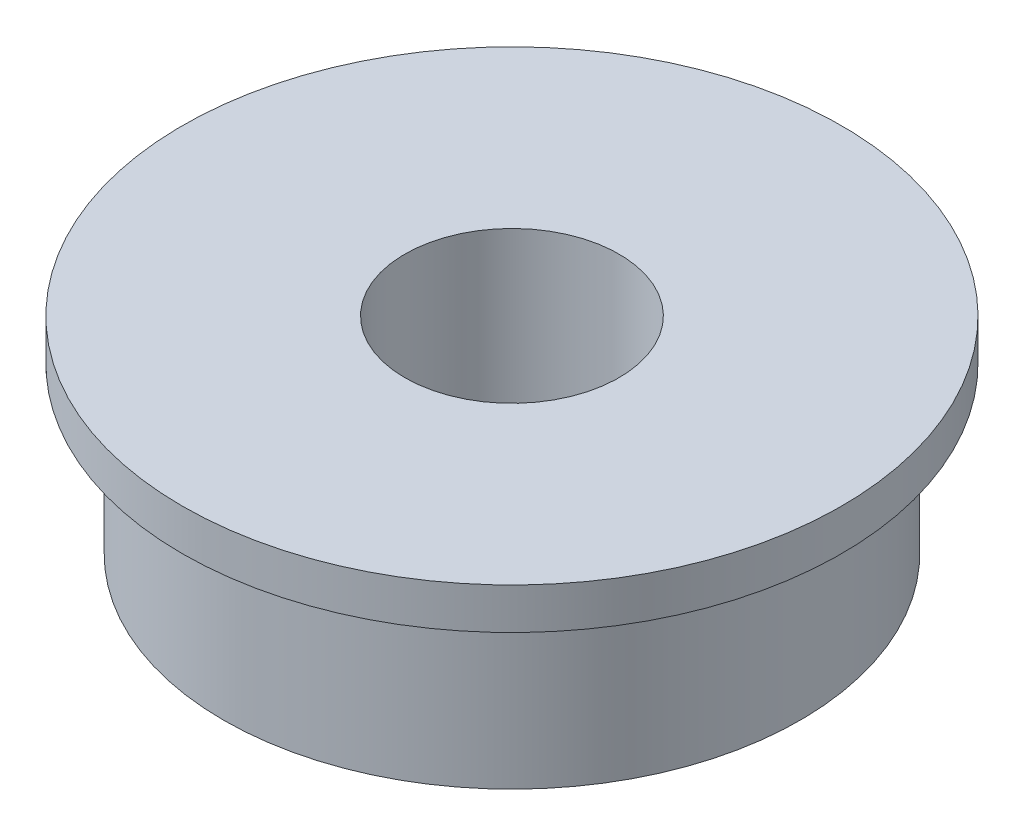
ISO-10303-21;
HEADER;
FILE_DESCRIPTION(('STEP AP214'),'2;1');
FILE_NAME('part.step','',(''),(''),'','','');
FILE_SCHEMA(('AUTOMOTIVE_DESIGN { 1 0 10303 214 1 1 1 1 }'));
ENDSEC;
DATA;
#1=APPLICATION_CONTEXT('core data for automotive mechanical design processes');
#2=APPLICATION_PROTOCOL_DEFINITION('international standard','automotive_design',2000,#1);
#3=PRODUCT_CONTEXT('',#1,'mechanical');
#4=PRODUCT('Part','Part','',(#3));
#5=PRODUCT_RELATED_PRODUCT_CATEGORY('part','',(#4));
#6=PRODUCT_DEFINITION_FORMATION('','',#4);
#7=PRODUCT_DEFINITION_CONTEXT('part definition',#1,'design');
#8=PRODUCT_DEFINITION('design','',#6,#7);
#9=PRODUCT_DEFINITION_SHAPE('','',#8);
#10=(LENGTH_UNIT() NAMED_UNIT(*) SI_UNIT(.MILLI.,.METRE.));
#11=(NAMED_UNIT(*) PLANE_ANGLE_UNIT() SI_UNIT($,.RADIAN.));
#12=(NAMED_UNIT(*) SI_UNIT($,.STERADIAN.) SOLID_ANGLE_UNIT());
#13=UNCERTAINTY_MEASURE_WITH_UNIT(LENGTH_MEASURE(1.E-05),#10,'distance_accuracy_value','');
#14=(GEOMETRIC_REPRESENTATION_CONTEXT(3) GLOBAL_UNCERTAINTY_ASSIGNED_CONTEXT((#13)) GLOBAL_UNIT_ASSIGNED_CONTEXT((#10,
#11,#12)) REPRESENTATION_CONTEXT('',''));
#15=CARTESIAN_POINT('',(0.,0.,0.));
#16=DIRECTION('',(0.,0.,1.));
#17=DIRECTION('',(1.,0.,0.));
#18=AXIS2_PLACEMENT_3D('',#15,#16,#17);
#19=CARTESIAN_POINT('',(0.,5.,0.));
#20=DIRECTION('',(0.,-1.,0.));
#21=DIRECTION('',(0.,0.,-1.));
#22=AXIS2_PLACEMENT_3D('',#19,#20,#21);
#23=CYLINDRICAL_SURFACE('',#22,7.);
#24=CARTESIAN_POINT('',(0.,0.,0.));
#25=DIRECTION('',(0.,1.,0.));
#26=DIRECTION('',(0.,0.,1.));
#27=AXIS2_PLACEMENT_3D('',#24,#25,#26);
#28=CIRCLE('',#27,7.);
#29=CARTESIAN_POINT('',(0.,0.,7.));
#30=VERTEX_POINT('',#29);
#31=EDGE_CURVE('E37',#30,#30,#28,.T.);
#32=ORIENTED_EDGE('',*,*,#31,.T.);
#33=EDGE_LOOP('',(#32));
#34=FACE_BOUND('',#33,.T.);
#35=CARTESIAN_POINT('',(0.,4.,0.));
#36=DIRECTION('',(0.,1.,0.));
#37=DIRECTION('',(0.,0.,1.));
#38=AXIS2_PLACEMENT_3D('',#35,#36,#37);
#39=CIRCLE('',#38,7.);
#40=CARTESIAN_POINT('',(0.,4.,7.));
#41=VERTEX_POINT('',#40);
#42=EDGE_CURVE('E10',#41,#41,#39,.T.);
#43=ORIENTED_EDGE('',*,*,#42,.F.);
#44=EDGE_LOOP('',(#43));
#45=FACE_BOUND('',#44,.T.);
#46=ADVANCED_FACE('F34',(#34,#45),#23,.T.);
#47=CARTESIAN_POINT('',(0.,5.,0.));
#48=DIRECTION('',(0.,1.,0.));
#49=DIRECTION('',(0.,0.,1.));
#50=AXIS2_PLACEMENT_3D('',#47,#48,#49);
#51=PLANE('',#50);
#52=CARTESIAN_POINT('',(0.,5.,0.));
#53=DIRECTION('',(0.,1.,0.));
#54=DIRECTION('',(0.,0.,1.));
#55=AXIS2_PLACEMENT_3D('',#52,#53,#54);
#56=CIRCLE('',#55,2.6);
#57=CARTESIAN_POINT('',(0.,5.,2.6));
#58=VERTEX_POINT('',#57);
#59=EDGE_CURVE('E45',#58,#58,#56,.T.);
#60=ORIENTED_EDGE('',*,*,#59,.F.);
#61=EDGE_LOOP('',(#60));
#62=FACE_BOUND('',#61,.T.);
#63=CARTESIAN_POINT('',(0.,5.,0.));
#64=DIRECTION('',(0.,1.,0.));
#65=DIRECTION('',(0.,0.,1.));
#66=AXIS2_PLACEMENT_3D('',#63,#64,#65);
#67=CIRCLE('',#66,8.);
#68=CARTESIAN_POINT('',(0.,5.,8.));
#69=VERTEX_POINT('',#68);
#70=EDGE_CURVE('E48',#69,#69,#67,.T.);
#71=ORIENTED_EDGE('',*,*,#70,.T.);
#72=EDGE_LOOP('',(#71));
#73=FACE_BOUND('',#72,.T.);
#74=ADVANCED_FACE('F62',(#62,#73),#51,.T.);
#75=CARTESIAN_POINT('',(0.,0.,0.));
#76=DIRECTION('',(0.,1.,0.));
#77=DIRECTION('',(0.,0.,1.));
#78=AXIS2_PLACEMENT_3D('',#75,#76,#77);
#79=PLANE('',#78);
#80=ORIENTED_EDGE('',*,*,#31,.F.);
#81=EDGE_LOOP('',(#80));
#82=FACE_BOUND('',#81,.T.);
#83=CARTESIAN_POINT('',(0.,0.,0.));
#84=DIRECTION('',(0.,1.,0.));
#85=DIRECTION('',(0.,0.,1.));
#86=AXIS2_PLACEMENT_3D('',#83,#84,#85);
#87=CIRCLE('',#86,2.6);
#88=CARTESIAN_POINT('',(0.,0.,2.6));
#89=VERTEX_POINT('',#88);
#90=EDGE_CURVE('E51',#89,#89,#87,.T.);
#91=ORIENTED_EDGE('',*,*,#90,.T.);
#92=EDGE_LOOP('',(#91));
#93=FACE_BOUND('',#92,.T.);
#94=ADVANCED_FACE('F80',(#82,#93),#79,.F.);
#95=CARTESIAN_POINT('',(0.,5.,0.));
#96=DIRECTION('',(0.,-1.,0.));
#97=DIRECTION('',(0.,0.,-1.));
#98=AXIS2_PLACEMENT_3D('',#95,#96,#97);
#99=CYLINDRICAL_SURFACE('',#98,2.6);
#100=ORIENTED_EDGE('',*,*,#59,.T.);
#101=EDGE_LOOP('',(#100));
#102=FACE_BOUND('',#101,.T.);
#103=ORIENTED_EDGE('',*,*,#90,.F.);
#104=EDGE_LOOP('',(#103));
#105=FACE_BOUND('',#104,.T.);
#106=ADVANCED_FACE('F71',(#102,#105),#99,.F.);
#107=CARTESIAN_POINT('',(0.,4.,0.));
#108=DIRECTION('',(0.,1.,0.));
#109=DIRECTION('',(0.,0.,1.));
#110=AXIS2_PLACEMENT_3D('',#107,#108,#109);
#111=PLANE('',#110);
#112=CARTESIAN_POINT('',(0.,4.,0.));
#113=DIRECTION('',(0.,1.,0.));
#114=DIRECTION('',(0.,0.,1.));
#115=AXIS2_PLACEMENT_3D('',#112,#113,#114);
#116=CIRCLE('',#115,8.);
#117=CARTESIAN_POINT('',(0.,4.,8.));
#118=VERTEX_POINT('',#117);
#119=EDGE_CURVE('E53',#118,#118,#116,.T.);
#120=ORIENTED_EDGE('',*,*,#119,.F.);
#121=EDGE_LOOP('',(#120));
#122=FACE_BOUND('',#121,.T.);
#123=ORIENTED_EDGE('',*,*,#42,.T.);
#124=EDGE_LOOP('',(#123));
#125=FACE_BOUND('',#124,.T.);
#126=ADVANCED_FACE('F66',(#122,#125),#111,.F.);
#127=CARTESIAN_POINT('',(0.,4.,0.));
#128=DIRECTION('',(0.,1.,0.));
#129=DIRECTION('',(0.,0.,1.));
#130=AXIS2_PLACEMENT_3D('',#127,#128,#129);
#131=CYLINDRICAL_SURFACE('',#130,8.);
#132=ORIENTED_EDGE('',*,*,#119,.T.);
#133=EDGE_LOOP('',(#132));
#134=FACE_BOUND('',#133,.T.);
#135=ORIENTED_EDGE('',*,*,#70,.F.);
#136=EDGE_LOOP('',(#135));
#137=FACE_BOUND('',#136,.T.);
#138=ADVANCED_FACE('F64',(#134,#137),#131,.T.);
#139=CLOSED_SHELL('',(#46,#74,#94,#106,#126,#138));
#140=MANIFOLD_SOLID_BREP('B2',#139);
#141=ADVANCED_BREP_SHAPE_REPRESENTATION('',(#18,#140),#14);
#142=SHAPE_DEFINITION_REPRESENTATION(#9,#141);
ENDSEC;
END-ISO-10303-21;
